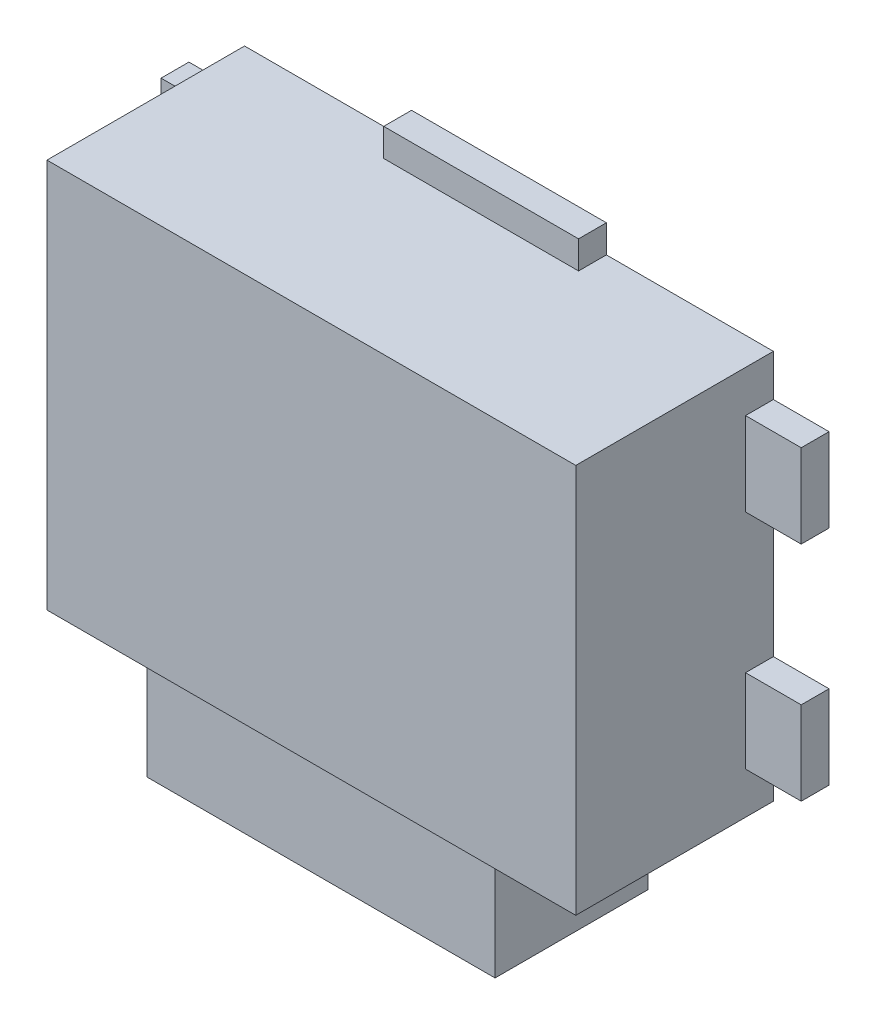
ISO-10303-21;
HEADER;
FILE_DESCRIPTION(('STEP AP214'),'2;1');
FILE_NAME('part.step','',(''),(''),'','','');
FILE_SCHEMA(('AUTOMOTIVE_DESIGN { 1 0 10303 214 1 1 1 1 }'));
ENDSEC;
DATA;
#1=APPLICATION_CONTEXT('core data for automotive mechanical design processes');
#2=APPLICATION_PROTOCOL_DEFINITION('international standard','automotive_design',2000,#1);
#3=PRODUCT_CONTEXT('',#1,'mechanical');
#4=PRODUCT('Part','Part','',(#3));
#5=PRODUCT_RELATED_PRODUCT_CATEGORY('part','',(#4));
#6=PRODUCT_DEFINITION_FORMATION('','',#4);
#7=PRODUCT_DEFINITION_CONTEXT('part definition',#1,'design');
#8=PRODUCT_DEFINITION('design','',#6,#7);
#9=PRODUCT_DEFINITION_SHAPE('','',#8);
#10=(LENGTH_UNIT() NAMED_UNIT(*) SI_UNIT(.MILLI.,.METRE.));
#11=(NAMED_UNIT(*) PLANE_ANGLE_UNIT() SI_UNIT($,.RADIAN.));
#12=(NAMED_UNIT(*) SI_UNIT($,.STERADIAN.) SOLID_ANGLE_UNIT());
#13=UNCERTAINTY_MEASURE_WITH_UNIT(LENGTH_MEASURE(1.E-05),#10,'distance_accuracy_value','');
#14=(GEOMETRIC_REPRESENTATION_CONTEXT(3) GLOBAL_UNCERTAINTY_ASSIGNED_CONTEXT((#13)) GLOBAL_UNIT_ASSIGNED_CONTEXT((#10,
#11,#12)) REPRESENTATION_CONTEXT('',''));
#15=CARTESIAN_POINT('',(0.,0.,0.));
#16=DIRECTION('',(0.,0.,1.));
#17=DIRECTION('',(1.,0.,0.));
#18=AXIS2_PLACEMENT_3D('',#15,#16,#17);
#19=CARTESIAN_POINT('',(1.25,-1.85,0.85));
#20=DIRECTION('',(0.,0.,-1.));
#21=DIRECTION('',(0.,-1.,0.));
#22=AXIS2_PLACEMENT_3D('',#19,#20,#21);
#23=PLANE('',#22);
#24=DIRECTION('',(1.,0.,0.));
#25=VECTOR('',#24,1.);
#26=CARTESIAN_POINT('',(-1.25,-0.4,0.85));
#27=LINE('',#26,#25);
#28=CARTESIAN_POINT('',(-1.25,-0.4,0.85));
#29=VERTEX_POINT('',#28);
#30=CARTESIAN_POINT('',(1.25,-0.4,0.85));
#31=VERTEX_POINT('',#30);
#32=EDGE_CURVE('E20',#29,#31,#27,.T.);
#33=ORIENTED_EDGE('',*,*,#32,.T.);
#34=DIRECTION('',(0.,-1.,0.));
#35=VECTOR('',#34,1.);
#36=CARTESIAN_POINT('',(1.25,-1.85,0.85));
#37=LINE('',#36,#35);
#38=CARTESIAN_POINT('',(1.25,-1.4,0.85));
#39=VERTEX_POINT('',#38);
#40=EDGE_CURVE('E629',#31,#39,#37,.T.);
#41=ORIENTED_EDGE('',*,*,#40,.T.);
#42=DIRECTION('',(0.,-1.,0.));
#43=VECTOR('',#42,1.);
#44=CARTESIAN_POINT('',(1.25,-1.85,0.85));
#45=LINE('',#44,#43);
#46=CARTESIAN_POINT('',(1.25,-1.85,0.85));
#47=VERTEX_POINT('',#46);
#48=EDGE_CURVE('E565',#39,#47,#45,.T.);
#49=ORIENTED_EDGE('',*,*,#48,.T.);
#50=DIRECTION('',(1.,0.,0.));
#51=VECTOR('',#50,1.);
#52=CARTESIAN_POINT('',(1.25,-1.85,0.85));
#53=LINE('',#52,#51);
#54=CARTESIAN_POINT('',(-1.25,-1.85,0.85));
#55=VERTEX_POINT('',#54);
#56=EDGE_CURVE('E11',#55,#47,#53,.T.);
#57=ORIENTED_EDGE('',*,*,#56,.F.);
#58=DIRECTION('',(0.,1.,0.));
#59=VECTOR('',#58,1.);
#60=CARTESIAN_POINT('',(-1.25,-1.85,0.85));
#61=LINE('',#60,#59);
#62=CARTESIAN_POINT('',(-1.25,-1.4,0.85));
#63=VERTEX_POINT('',#62);
#64=EDGE_CURVE('E432',#55,#63,#61,.T.);
#65=ORIENTED_EDGE('',*,*,#64,.T.);
#66=DIRECTION('',(0.,1.,0.));
#67=VECTOR('',#66,1.);
#68=CARTESIAN_POINT('',(-1.25,-1.85,0.85));
#69=LINE('',#68,#67);
#70=EDGE_CURVE('E342',#63,#29,#69,.T.);
#71=ORIENTED_EDGE('',*,*,#70,.T.);
#72=EDGE_LOOP('',(#33,#41,#49,#57,#65,#71));
#73=FACE_BOUND('',#72,.T.);
#74=ADVANCED_FACE('F17',(#73),#23,.T.);
#75=CARTESIAN_POINT('',(1.25,-1.85,0.15));
#76=DIRECTION('',(0.,1.,0.));
#77=DIRECTION('',(0.,0.,-1.));
#78=AXIS2_PLACEMENT_3D('',#75,#76,#77);
#79=PLANE('',#78);
#80=DIRECTION('',(0.,0.,1.));
#81=VECTOR('',#80,1.);
#82=CARTESIAN_POINT('',(-1.25,-1.85,0.15));
#83=LINE('',#82,#81);
#84=CARTESIAN_POINT('',(-1.25,-1.85,0.25));
#85=VERTEX_POINT('',#84);
#86=EDGE_CURVE('E435',#85,#55,#83,.T.);
#87=ORIENTED_EDGE('',*,*,#86,.T.);
#88=ORIENTED_EDGE('',*,*,#56,.T.);
#89=DIRECTION('',(0.,0.,-1.));
#90=VECTOR('',#89,1.);
#91=CARTESIAN_POINT('',(1.25,-1.85,0.15));
#92=LINE('',#91,#90);
#93=CARTESIAN_POINT('',(1.25,-1.85,0.25));
#94=VERTEX_POINT('',#93);
#95=EDGE_CURVE('E564',#47,#94,#92,.T.);
#96=ORIENTED_EDGE('',*,*,#95,.T.);
#97=DIRECTION('',(1.,0.,0.));
#98=VECTOR('',#97,1.);
#99=CARTESIAN_POINT('',(1.25,-1.85,0.25));
#100=LINE('',#99,#98);
#101=EDGE_CURVE('E635',#85,#94,#100,.T.);
#102=ORIENTED_EDGE('',*,*,#101,.F.);
#103=EDGE_LOOP('',(#87,#88,#96,#102));
#104=FACE_BOUND('',#103,.T.);
#105=ADVANCED_FACE('F1546',(#104),#79,.T.);
#106=CARTESIAN_POINT('',(-1.25,-0.4,1.35));
#107=DIRECTION('',(0.,-1.,0.));
#108=DIRECTION('',(-1.,0.,0.));
#109=AXIS2_PLACEMENT_3D('',#106,#107,#108);
#110=PLANE('',#109);
#111=ORIENTED_EDGE('',*,*,#32,.F.);
#112=DIRECTION('',(0.,0.,-1.));
#113=VECTOR('',#112,1.);
#114=CARTESIAN_POINT('',(-1.25,-0.4,1.35));
#115=LINE('',#114,#113);
#116=CARTESIAN_POINT('',(-1.25,-0.4,1.35));
#117=VERTEX_POINT('',#116);
#118=EDGE_CURVE('E538',#117,#29,#115,.T.);
#119=ORIENTED_EDGE('',*,*,#118,.F.);
#120=DIRECTION('',(-1.,0.,0.));
#121=VECTOR('',#120,1.);
#122=CARTESIAN_POINT('',(-1.25,-0.4,1.35));
#123=LINE('',#122,#121);
#124=CARTESIAN_POINT('',(1.25,-0.4,1.35));
#125=VERTEX_POINT('',#124);
#126=EDGE_CURVE('E39',#125,#117,#123,.T.);
#127=ORIENTED_EDGE('',*,*,#126,.F.);
#128=DIRECTION('',(0.,0.,1.));
#129=VECTOR('',#128,1.);
#130=CARTESIAN_POINT('',(1.25,-0.4,1.35));
#131=LINE('',#130,#129);
#132=EDGE_CURVE('E559',#31,#125,#131,.T.);
#133=ORIENTED_EDGE('',*,*,#132,.F.);
#134=EDGE_LOOP('',(#111,#119,#127,#133));
#135=FACE_BOUND('',#134,.T.);
#136=ADVANCED_FACE('F732',(#135),#110,.F.);
#137=CARTESIAN_POINT('',(1.25,-0.4,0.25));
#138=DIRECTION('',(0.,0.,-1.));
#139=DIRECTION('',(0.,-1.,0.));
#140=AXIS2_PLACEMENT_3D('',#137,#138,#139);
#141=PLANE('',#140);
#142=DIRECTION('',(1.,0.,0.));
#143=VECTOR('',#142,1.);
#144=CARTESIAN_POINT('',(-1.25,-2.15,0.25));
#145=LINE('',#144,#143);
#146=CARTESIAN_POINT('',(-1.25,-2.15,0.25));
#147=VERTEX_POINT('',#146);
#148=CARTESIAN_POINT('',(1.25,-2.15,0.25));
#149=VERTEX_POINT('',#148);
#150=EDGE_CURVE('E475',#147,#149,#145,.T.);
#151=ORIENTED_EDGE('',*,*,#150,.F.);
#152=DIRECTION('',(0.,1.,0.));
#153=VECTOR('',#152,1.);
#154=CARTESIAN_POINT('',(-1.25,-0.4,0.25));
#155=LINE('',#154,#153);
#156=EDGE_CURVE('E589',#147,#85,#155,.T.);
#157=ORIENTED_EDGE('',*,*,#156,.T.);
#158=ORIENTED_EDGE('',*,*,#101,.T.);
#159=DIRECTION('',(0.,-1.,0.));
#160=VECTOR('',#159,1.);
#161=CARTESIAN_POINT('',(1.25,-0.4,0.25));
#162=LINE('',#161,#160);
#163=EDGE_CURVE('E554',#94,#149,#162,.T.);
#164=ORIENTED_EDGE('',*,*,#163,.T.);
#165=EDGE_LOOP('',(#151,#157,#158,#164));
#166=FACE_BOUND('',#165,.T.);
#167=ADVANCED_FACE('F1525',(#166),#141,.T.);
#168=CARTESIAN_POINT('',(-1.25,-1.4,1.35));
#169=DIRECTION('',(0.,0.,-1.));
#170=DIRECTION('',(0.,-1.,0.));
#171=AXIS2_PLACEMENT_3D('',#168,#169,#170);
#172=PLANE('',#171);
#173=DIRECTION('',(-1.,0.,0.));
#174=VECTOR('',#173,1.);
#175=CARTESIAN_POINT('',(-1.25,0.6,1.35));
#176=LINE('',#175,#174);
#177=CARTESIAN_POINT('',(1.25,0.6,1.35));
#178=VERTEX_POINT('',#177);
#179=CARTESIAN_POINT('',(-1.25,0.6,1.35));
#180=VERTEX_POINT('',#179);
#181=EDGE_CURVE('E628',#178,#180,#176,.T.);
#182=ORIENTED_EDGE('',*,*,#181,.F.);
#183=DIRECTION('',(0.,1.,0.));
#184=VECTOR('',#183,1.);
#185=CARTESIAN_POINT('',(1.25,-1.4,1.35));
#186=LINE('',#185,#184);
#187=EDGE_CURVE('E478',#125,#178,#186,.T.);
#188=ORIENTED_EDGE('',*,*,#187,.F.);
#189=ORIENTED_EDGE('',*,*,#126,.T.);
#190=DIRECTION('',(0.,1.,0.));
#191=VECTOR('',#190,1.);
#192=CARTESIAN_POINT('',(-1.25,-1.4,1.35));
#193=LINE('',#192,#191);
#194=EDGE_CURVE('E503',#117,#180,#193,.T.);
#195=ORIENTED_EDGE('',*,*,#194,.T.);
#196=EDGE_LOOP('',(#182,#188,#189,#195));
#197=FACE_BOUND('',#196,.T.);
#198=ADVANCED_FACE('F1516',(#197),#172,.T.);
#199=CARTESIAN_POINT('',(-2.3,0.5,0.));
#200=DIRECTION('',(-1.,0.,0.));
#201=DIRECTION('',(0.,0.,1.));
#202=AXIS2_PLACEMENT_3D('',#199,#200,#201);
#203=PLANE('',#202);
#204=DIRECTION('',(0.,0.,1.));
#205=VECTOR('',#204,1.);
#206=CARTESIAN_POINT('',(-2.3,1.1,0.));
#207=LINE('',#206,#205);
#208=CARTESIAN_POINT('',(-2.3,1.1,0.));
#209=VERTEX_POINT('',#208);
#210=CARTESIAN_POINT('',(-2.3,1.1,0.2));
#211=VERTEX_POINT('',#210);
#212=EDGE_CURVE('E541',#209,#211,#207,.T.);
#213=ORIENTED_EDGE('',*,*,#212,.F.);
#214=DIRECTION('',(0.,-1.,0.));
#215=VECTOR('',#214,1.);
#216=CARTESIAN_POINT('',(-2.3,0.5,0.));
#217=LINE('',#216,#215);
#218=CARTESIAN_POINT('',(-2.3,0.5,0.));
#219=VERTEX_POINT('',#218);
#220=EDGE_CURVE('E582',#209,#219,#217,.T.);
#221=ORIENTED_EDGE('',*,*,#220,.T.);
#222=DIRECTION('',(0.,0.,-1.));
#223=VECTOR('',#222,1.);
#224=CARTESIAN_POINT('',(-2.3,0.5,0.));
#225=LINE('',#224,#223);
#226=CARTESIAN_POINT('',(-2.3,0.5,0.2));
#227=VERTEX_POINT('',#226);
#228=EDGE_CURVE('E510',#227,#219,#225,.T.);
#229=ORIENTED_EDGE('',*,*,#228,.F.);
#230=DIRECTION('',(0.,-1.,0.));
#231=VECTOR('',#230,1.);
#232=CARTESIAN_POINT('',(-2.3,1.1,0.2));
#233=LINE('',#232,#231);
#234=EDGE_CURVE('E620',#211,#227,#233,.T.);
#235=ORIENTED_EDGE('',*,*,#234,.F.);
#236=EDGE_LOOP('',(#213,#221,#229,#235));
#237=FACE_BOUND('',#236,.T.);
#238=ADVANCED_FACE('F1417',(#237),#203,.T.);
#239=CARTESIAN_POINT('',(-2.299999999999,-1.1,0.));
#240=DIRECTION('',(-1.,0.,0.));
#241=DIRECTION('',(0.,0.,1.));
#242=AXIS2_PLACEMENT_3D('',#239,#240,#241);
#243=PLANE('',#242);
#244=DIRECTION('',(0.,0.,1.));
#245=VECTOR('',#244,1.);
#246=CARTESIAN_POINT('',(-2.299999999999,-0.5,0.));
#247=LINE('',#246,#245);
#248=CARTESIAN_POINT('',(-2.299999999999,-0.5,0.));
#249=VERTEX_POINT('',#248);
#250=CARTESIAN_POINT('',(-2.299999999999,-0.5,0.2));
#251=VERTEX_POINT('',#250);
#252=EDGE_CURVE('E511',#249,#251,#247,.T.);
#253=ORIENTED_EDGE('',*,*,#252,.F.);
#254=DIRECTION('',(0.,-1.,0.));
#255=VECTOR('',#254,1.);
#256=CARTESIAN_POINT('',(-2.299999999999,-1.1,0.));
#257=LINE('',#256,#255);
#258=CARTESIAN_POINT('',(-2.299999999999,-1.1,0.));
#259=VERTEX_POINT('',#258);
#260=EDGE_CURVE('E458',#249,#259,#257,.T.);
#261=ORIENTED_EDGE('',*,*,#260,.T.);
#262=DIRECTION('',(0.,0.,-1.));
#263=VECTOR('',#262,1.);
#264=CARTESIAN_POINT('',(-2.299999999999,-1.1,0.));
#265=LINE('',#264,#263);
#266=CARTESIAN_POINT('',(-2.299999999999,-1.1,0.2));
#267=VERTEX_POINT('',#266);
#268=EDGE_CURVE('E431',#267,#259,#265,.T.);
#269=ORIENTED_EDGE('',*,*,#268,.F.);
#270=DIRECTION('',(0.,-1.,0.));
#271=VECTOR('',#270,1.);
#272=CARTESIAN_POINT('',(-2.299999999999,-0.5,0.2));
#273=LINE('',#272,#271);
#274=EDGE_CURVE('E430',#251,#267,#273,.T.);
#275=ORIENTED_EDGE('',*,*,#274,.F.);
#276=EDGE_LOOP('',(#253,#261,#269,#275));
#277=FACE_BOUND('',#276,.T.);
#278=ADVANCED_FACE('F1412',(#277),#243,.T.);
#279=CARTESIAN_POINT('',(-1.25,-2.15,1.35));
#280=DIRECTION('',(0.,-1.,0.));
#281=DIRECTION('',(-1.,0.,0.));
#282=AXIS2_PLACEMENT_3D('',#279,#280,#281);
#283=PLANE('',#282);
#284=DIRECTION('',(0.,0.,1.));
#285=VECTOR('',#284,1.);
#286=CARTESIAN_POINT('',(1.25,-2.15,1.35));
#287=LINE('',#286,#285);
#288=CARTESIAN_POINT('',(1.25,-2.15,1.35));
#289=VERTEX_POINT('',#288);
#290=EDGE_CURVE('E573',#149,#289,#287,.T.);
#291=ORIENTED_EDGE('',*,*,#290,.T.);
#292=DIRECTION('',(1.,0.,0.));
#293=VECTOR('',#292,1.);
#294=CARTESIAN_POINT('',(-1.25,-2.15,1.35));
#295=LINE('',#294,#293);
#296=CARTESIAN_POINT('',(-1.25,-2.15,1.35));
#297=VERTEX_POINT('',#296);
#298=EDGE_CURVE('E551',#297,#289,#295,.T.);
#299=ORIENTED_EDGE('',*,*,#298,.F.);
#300=DIRECTION('',(0.,0.,1.));
#301=VECTOR('',#300,1.);
#302=CARTESIAN_POINT('',(-1.25,-2.15,0.25));
#303=LINE('',#302,#301);
#304=EDGE_CURVE('E416',#147,#297,#303,.T.);
#305=ORIENTED_EDGE('',*,*,#304,.F.);
#306=ORIENTED_EDGE('',*,*,#150,.T.);
#307=EDGE_LOOP('',(#291,#299,#305,#306));
#308=FACE_BOUND('',#307,.T.);
#309=ADVANCED_FACE('F1416',(#308),#283,.T.);
#310=CARTESIAN_POINT('',(1.25,-1.4,1.35));
#311=DIRECTION('',(-1.,0.,0.));
#312=DIRECTION('',(0.,0.,1.));
#313=AXIS2_PLACEMENT_3D('',#310,#311,#312);
#314=PLANE('',#313);
#315=DIRECTION('',(0.,0.,1.));
#316=VECTOR('',#315,1.);
#317=CARTESIAN_POINT('',(1.25,-1.4,1.35));
#318=LINE('',#317,#316);
#319=CARTESIAN_POINT('',(1.25,-1.4,0.8));
#320=VERTEX_POINT('',#319);
#321=EDGE_CURVE('E353',#320,#39,#318,.T.);
#322=ORIENTED_EDGE('',*,*,#321,.T.);
#323=ORIENTED_EDGE('',*,*,#40,.F.);
#324=ORIENTED_EDGE('',*,*,#132,.T.);
#325=ORIENTED_EDGE('',*,*,#187,.T.);
#326=DIRECTION('',(0.,0.,1.));
#327=VECTOR('',#326,1.);
#328=CARTESIAN_POINT('',(1.25,0.6,1.35));
#329=LINE('',#328,#327);
#330=CARTESIAN_POINT('',(1.25,0.6,0.8));
#331=VERTEX_POINT('',#330);
#332=EDGE_CURVE('E523',#331,#178,#329,.T.);
#333=ORIENTED_EDGE('',*,*,#332,.F.);
#334=DIRECTION('',(0.,1.,0.));
#335=VECTOR('',#334,1.);
#336=CARTESIAN_POINT('',(1.25,-1.4,0.8));
#337=LINE('',#336,#335);
#338=EDGE_CURVE('E335',#320,#331,#337,.T.);
#339=ORIENTED_EDGE('',*,*,#338,.F.);
#340=EDGE_LOOP('',(#322,#323,#324,#325,#333,#339));
#341=FACE_BOUND('',#340,.T.);
#342=ADVANCED_FACE('F728',(#341),#314,.T.);
#343=CARTESIAN_POINT('',(-1.25,0.6,1.35));
#344=DIRECTION('',(0.,-1.,0.));
#345=DIRECTION('',(0.,0.,-1.));
#346=AXIS2_PLACEMENT_3D('',#343,#344,#345);
#347=PLANE('',#346);
#348=ORIENTED_EDGE('',*,*,#332,.T.);
#349=ORIENTED_EDGE('',*,*,#181,.T.);
#350=DIRECTION('',(0.,0.,1.));
#351=VECTOR('',#350,1.);
#352=CARTESIAN_POINT('',(-1.25,0.6,0.8));
#353=LINE('',#352,#351);
#354=CARTESIAN_POINT('',(-1.25,0.6,0.8));
#355=VERTEX_POINT('',#354);
#356=EDGE_CURVE('E500',#355,#180,#353,.T.);
#357=ORIENTED_EDGE('',*,*,#356,.F.);
#358=DIRECTION('',(-1.,0.,0.));
#359=VECTOR('',#358,1.);
#360=CARTESIAN_POINT('',(1.25,0.6,0.8));
#361=LINE('',#360,#359);
#362=EDGE_CURVE('E331',#331,#355,#361,.T.);
#363=ORIENTED_EDGE('',*,*,#362,.F.);
#364=EDGE_LOOP('',(#348,#349,#357,#363));
#365=FACE_BOUND('',#364,.T.);
#366=ADVANCED_FACE('F731',(#365),#347,.T.);
#367=CARTESIAN_POINT('',(-1.25,-1.4,0.8));
#368=DIRECTION('',(1.,0.,0.));
#369=DIRECTION('',(0.,1.,0.));
#370=AXIS2_PLACEMENT_3D('',#367,#368,#369);
#371=PLANE('',#370);
#372=ORIENTED_EDGE('',*,*,#118,.T.);
#373=ORIENTED_EDGE('',*,*,#70,.F.);
#374=DIRECTION('',(0.,0.,-1.));
#375=VECTOR('',#374,1.);
#376=CARTESIAN_POINT('',(-1.25,-1.4,0.8));
#377=LINE('',#376,#375);
#378=CARTESIAN_POINT('',(-1.25,-1.4,0.8));
#379=VERTEX_POINT('',#378);
#380=EDGE_CURVE('E339',#63,#379,#377,.T.);
#381=ORIENTED_EDGE('',*,*,#380,.T.);
#382=DIRECTION('',(0.,-1.,0.));
#383=VECTOR('',#382,1.);
#384=CARTESIAN_POINT('',(-1.25,-1.4,0.8));
#385=LINE('',#384,#383);
#386=EDGE_CURVE('E323',#355,#379,#385,.T.);
#387=ORIENTED_EDGE('',*,*,#386,.F.);
#388=ORIENTED_EDGE('',*,*,#356,.T.);
#389=ORIENTED_EDGE('',*,*,#194,.F.);
#390=EDGE_LOOP('',(#372,#373,#381,#387,#388,#389));
#391=FACE_BOUND('',#390,.T.);
#392=ADVANCED_FACE('F341',(#391),#371,.T.);
#393=CARTESIAN_POINT('',(2.3,-0.5,0.));
#394=DIRECTION('',(1.,0.,0.));
#395=DIRECTION('',(0.,1.,0.));
#396=AXIS2_PLACEMENT_3D('',#393,#394,#395);
#397=PLANE('',#396);
#398=DIRECTION('',(0.,0.,1.));
#399=VECTOR('',#398,1.);
#400=CARTESIAN_POINT('',(2.3,-1.1,0.));
#401=LINE('',#400,#399);
#402=CARTESIAN_POINT('',(2.3,-1.1,0.));
#403=VERTEX_POINT('',#402);
#404=CARTESIAN_POINT('',(2.3,-1.1,0.2));
#405=VERTEX_POINT('',#404);
#406=EDGE_CURVE('E336',#403,#405,#401,.T.);
#407=ORIENTED_EDGE('',*,*,#406,.F.);
#408=DIRECTION('',(0.,1.,0.));
#409=VECTOR('',#408,1.);
#410=CARTESIAN_POINT('',(2.3,-0.5,0.));
#411=LINE('',#410,#409);
#412=CARTESIAN_POINT('',(2.3,-0.5,0.));
#413=VERTEX_POINT('',#412);
#414=EDGE_CURVE('E459',#403,#413,#411,.T.);
#415=ORIENTED_EDGE('',*,*,#414,.T.);
#416=DIRECTION('',(0.,0.,-1.));
#417=VECTOR('',#416,1.);
#418=CARTESIAN_POINT('',(2.3,-0.5,0.));
#419=LINE('',#418,#417);
#420=CARTESIAN_POINT('',(2.3,-0.5,0.2));
#421=VERTEX_POINT('',#420);
#422=EDGE_CURVE('E545',#421,#413,#419,.T.);
#423=ORIENTED_EDGE('',*,*,#422,.F.);
#424=DIRECTION('',(0.,1.,0.));
#425=VECTOR('',#424,1.);
#426=CARTESIAN_POINT('',(2.3,-0.5,0.2));
#427=LINE('',#426,#425);
#428=EDGE_CURVE('E388',#405,#421,#427,.T.);
#429=ORIENTED_EDGE('',*,*,#428,.F.);
#430=EDGE_LOOP('',(#407,#415,#423,#429));
#431=FACE_BOUND('',#430,.T.);
#432=ADVANCED_FACE('F1459',(#431),#397,.T.);
#433=CARTESIAN_POINT('',(2.3,1.1,0.));
#434=DIRECTION('',(1.,0.,0.));
#435=DIRECTION('',(0.,1.,0.));
#436=AXIS2_PLACEMENT_3D('',#433,#434,#435);
#437=PLANE('',#436);
#438=DIRECTION('',(0.,0.,1.));
#439=VECTOR('',#438,1.);
#440=CARTESIAN_POINT('',(2.3,0.5,0.));
#441=LINE('',#440,#439);
#442=CARTESIAN_POINT('',(2.3,0.5,0.));
#443=VERTEX_POINT('',#442);
#444=CARTESIAN_POINT('',(2.3,0.5,0.2));
#445=VERTEX_POINT('',#444);
#446=EDGE_CURVE('E403',#443,#445,#441,.T.);
#447=ORIENTED_EDGE('',*,*,#446,.F.);
#448=DIRECTION('',(0.,1.,0.));
#449=VECTOR('',#448,1.);
#450=CARTESIAN_POINT('',(2.3,1.1,0.));
#451=LINE('',#450,#449);
#452=CARTESIAN_POINT('',(2.3,1.1,0.));
#453=VERTEX_POINT('',#452);
#454=EDGE_CURVE('E415',#443,#453,#451,.T.);
#455=ORIENTED_EDGE('',*,*,#454,.T.);
#456=DIRECTION('',(0.,0.,-1.));
#457=VECTOR('',#456,1.);
#458=CARTESIAN_POINT('',(2.3,1.1,0.));
#459=LINE('',#458,#457);
#460=CARTESIAN_POINT('',(2.3,1.1,0.2));
#461=VERTEX_POINT('',#460);
#462=EDGE_CURVE('E462',#461,#453,#459,.T.);
#463=ORIENTED_EDGE('',*,*,#462,.F.);
#464=DIRECTION('',(0.,1.,0.));
#465=VECTOR('',#464,1.);
#466=CARTESIAN_POINT('',(2.3,1.1,0.2));
#467=LINE('',#466,#465);
#468=EDGE_CURVE('E529',#445,#461,#467,.T.);
#469=ORIENTED_EDGE('',*,*,#468,.F.);
#470=EDGE_LOOP('',(#447,#455,#463,#469));
#471=FACE_BOUND('',#470,.T.);
#472=ADVANCED_FACE('F688',(#471),#437,.T.);
#473=CARTESIAN_POINT('',(-0.7,1.6,0.));
#474=DIRECTION('',(0.,1.,0.));
#475=DIRECTION('',(1.,0.,0.));
#476=AXIS2_PLACEMENT_3D('',#473,#474,#475);
#477=PLANE('',#476);
#478=DIRECTION('',(0.,0.,1.));
#479=VECTOR('',#478,1.);
#480=CARTESIAN_POINT('',(0.7,1.6,0.));
#481=LINE('',#480,#479);
#482=CARTESIAN_POINT('',(0.7,1.6,0.));
#483=VERTEX_POINT('',#482);
#484=CARTESIAN_POINT('',(0.7,1.6,0.2));
#485=VERTEX_POINT('',#484);
#486=EDGE_CURVE('E517',#483,#485,#481,.T.);
#487=ORIENTED_EDGE('',*,*,#486,.F.);
#488=DIRECTION('',(-1.,0.,0.));
#489=VECTOR('',#488,1.);
#490=CARTESIAN_POINT('',(-0.7,1.6,0.));
#491=LINE('',#490,#489);
#492=CARTESIAN_POINT('',(-0.7,1.6,0.));
#493=VERTEX_POINT('',#492);
#494=EDGE_CURVE('E412',#483,#493,#491,.T.);
#495=ORIENTED_EDGE('',*,*,#494,.T.);
#496=DIRECTION('',(0.,0.,1.));
#497=VECTOR('',#496,1.);
#498=CARTESIAN_POINT('',(-0.7,1.6,0.));
#499=LINE('',#498,#497);
#500=CARTESIAN_POINT('',(-0.7,1.6,0.2));
#501=VERTEX_POINT('',#500);
#502=EDGE_CURVE('E495',#493,#501,#499,.T.);
#503=ORIENTED_EDGE('',*,*,#502,.T.);
#504=DIRECTION('',(-1.,0.,0.));
#505=VECTOR('',#504,1.);
#506=CARTESIAN_POINT('',(-0.7,1.6,0.2));
#507=LINE('',#506,#505);
#508=EDGE_CURVE('E394',#485,#501,#507,.T.);
#509=ORIENTED_EDGE('',*,*,#508,.F.);
#510=EDGE_LOOP('',(#487,#495,#503,#509));
#511=FACE_BOUND('',#510,.T.);
#512=ADVANCED_FACE('F1442',(#511),#477,.T.);
#513=CARTESIAN_POINT('',(-2.3,1.1,0.));
#514=DIRECTION('',(0.,1.,0.));
#515=DIRECTION('',(1.,0.,0.));
#516=AXIS2_PLACEMENT_3D('',#513,#514,#515);
#517=PLANE('',#516);
#518=DIRECTION('',(-1.,0.,0.));
#519=VECTOR('',#518,1.);
#520=CARTESIAN_POINT('',(-2.3,1.1,0.2));
#521=LINE('',#520,#519);
#522=CARTESIAN_POINT('',(-1.9,1.1,0.2));
#523=VERTEX_POINT('',#522);
#524=EDGE_CURVE('E616',#523,#211,#521,.T.);
#525=ORIENTED_EDGE('',*,*,#524,.F.);
#526=DIRECTION('',(0.,0.,1.));
#527=VECTOR('',#526,1.);
#528=CARTESIAN_POINT('',(-1.9,1.1,0.));
#529=LINE('',#528,#527);
#530=CARTESIAN_POINT('',(-1.9,1.1,0.));
#531=VERTEX_POINT('',#530);
#532=EDGE_CURVE('E417',#531,#523,#529,.T.);
#533=ORIENTED_EDGE('',*,*,#532,.F.);
#534=DIRECTION('',(-1.,0.,0.));
#535=VECTOR('',#534,1.);
#536=CARTESIAN_POINT('',(-2.3,1.1,0.));
#537=LINE('',#536,#535);
#538=EDGE_CURVE('E600',#531,#209,#537,.T.);
#539=ORIENTED_EDGE('',*,*,#538,.T.);
#540=ORIENTED_EDGE('',*,*,#212,.T.);
#541=EDGE_LOOP('',(#525,#533,#539,#540));
#542=FACE_BOUND('',#541,.T.);
#543=ADVANCED_FACE('F1397',(#542),#517,.T.);
#544=CARTESIAN_POINT('',(-2.3,1.1,0.2));
#545=DIRECTION('',(0.,0.,1.));
#546=DIRECTION('',(1.,0.,0.));
#547=AXIS2_PLACEMENT_3D('',#544,#545,#546);
#548=PLANE('',#547);
#549=DIRECTION('',(-1.,0.,0.));
#550=VECTOR('',#549,1.);
#551=CARTESIAN_POINT('',(-1.6,0.5,0.2));
#552=LINE('',#551,#550);
#553=CARTESIAN_POINT('',(-1.9,0.5,0.2));
#554=VERTEX_POINT('',#553);
#555=EDGE_CURVE('E506',#554,#227,#552,.T.);
#556=ORIENTED_EDGE('',*,*,#555,.F.);
#557=DIRECTION('',(0.,-1.,0.));
#558=VECTOR('',#557,1.);
#559=CARTESIAN_POINT('',(-1.9,-1.4,0.2));
#560=LINE('',#559,#558);
#561=EDGE_CURVE('E421',#523,#554,#560,.T.);
#562=ORIENTED_EDGE('',*,*,#561,.F.);
#563=ORIENTED_EDGE('',*,*,#524,.T.);
#564=ORIENTED_EDGE('',*,*,#234,.T.);
#565=EDGE_LOOP('',(#556,#562,#563,#564));
#566=FACE_BOUND('',#565,.T.);
#567=ADVANCED_FACE('F1392',(#566),#548,.T.);
#568=CARTESIAN_POINT('',(-1.6,0.5,0.));
#569=DIRECTION('',(0.,-1.,0.));
#570=DIRECTION('',(0.,0.,-1.));
#571=AXIS2_PLACEMENT_3D('',#568,#569,#570);
#572=PLANE('',#571);
#573=ORIENTED_EDGE('',*,*,#555,.T.);
#574=ORIENTED_EDGE('',*,*,#228,.T.);
#575=DIRECTION('',(1.,0.,0.));
#576=VECTOR('',#575,1.);
#577=CARTESIAN_POINT('',(-1.6,0.5,0.));
#578=LINE('',#577,#576);
#579=CARTESIAN_POINT('',(-1.9,0.5,0.));
#580=VERTEX_POINT('',#579);
#581=EDGE_CURVE('E516',#219,#580,#578,.T.);
#582=ORIENTED_EDGE('',*,*,#581,.T.);
#583=DIRECTION('',(0.,0.,-1.));
#584=VECTOR('',#583,1.);
#585=CARTESIAN_POINT('',(-1.9,0.5,0.));
#586=LINE('',#585,#584);
#587=EDGE_CURVE('E474',#554,#580,#586,.T.);
#588=ORIENTED_EDGE('',*,*,#587,.F.);
#589=EDGE_LOOP('',(#573,#574,#582,#588));
#590=FACE_BOUND('',#589,.T.);
#591=ADVANCED_FACE('F1396',(#590),#572,.T.);
#592=CARTESIAN_POINT('',(-2.299999999999,-0.5,0.));
#593=DIRECTION('',(0.,1.,0.));
#594=DIRECTION('',(1.,0.,0.));
#595=AXIS2_PLACEMENT_3D('',#592,#593,#594);
#596=PLANE('',#595);
#597=DIRECTION('',(-1.,0.,0.));
#598=VECTOR('',#597,1.);
#599=CARTESIAN_POINT('',(-2.299999999999,-0.5,0.2));
#600=LINE('',#599,#598);
#601=CARTESIAN_POINT('',(-1.9,-0.5,0.2));
#602=VERTEX_POINT('',#601);
#603=EDGE_CURVE('E426',#602,#251,#600,.T.);
#604=ORIENTED_EDGE('',*,*,#603,.F.);
#605=DIRECTION('',(0.,0.,1.));
#606=VECTOR('',#605,1.);
#607=CARTESIAN_POINT('',(-1.9,-0.5,0.));
#608=LINE('',#607,#606);
#609=CARTESIAN_POINT('',(-1.9,-0.5,0.));
#610=VERTEX_POINT('',#609);
#611=EDGE_CURVE('E486',#610,#602,#608,.T.);
#612=ORIENTED_EDGE('',*,*,#611,.F.);
#613=DIRECTION('',(-1.,0.,0.));
#614=VECTOR('',#613,1.);
#615=CARTESIAN_POINT('',(-2.299999999999,-0.5,0.));
#616=LINE('',#615,#614);
#617=EDGE_CURVE('E512',#610,#249,#616,.T.);
#618=ORIENTED_EDGE('',*,*,#617,.T.);
#619=ORIENTED_EDGE('',*,*,#252,.T.);
#620=EDGE_LOOP('',(#604,#612,#618,#619));
#621=FACE_BOUND('',#620,.T.);
#622=ADVANCED_FACE('F1406',(#621),#596,.T.);
#623=CARTESIAN_POINT('',(-2.299999999999,-0.5,0.2));
#624=DIRECTION('',(0.,0.,1.));
#625=DIRECTION('',(1.,0.,0.));
#626=AXIS2_PLACEMENT_3D('',#623,#624,#625);
#627=PLANE('',#626);
#628=DIRECTION('',(-1.,0.,0.));
#629=VECTOR('',#628,1.);
#630=CARTESIAN_POINT('',(-1.599999999999,-1.1,0.2));
#631=LINE('',#630,#629);
#632=CARTESIAN_POINT('',(-1.9,-1.1,0.2));
#633=VERTEX_POINT('',#632);
#634=EDGE_CURVE('E604',#633,#267,#631,.T.);
#635=ORIENTED_EDGE('',*,*,#634,.F.);
#636=DIRECTION('',(0.,-1.,0.));
#637=VECTOR('',#636,1.);
#638=CARTESIAN_POINT('',(-1.9,-1.4,0.2));
#639=LINE('',#638,#637);
#640=EDGE_CURVE('E446',#602,#633,#639,.T.);
#641=ORIENTED_EDGE('',*,*,#640,.F.);
#642=ORIENTED_EDGE('',*,*,#603,.T.);
#643=ORIENTED_EDGE('',*,*,#274,.T.);
#644=EDGE_LOOP('',(#635,#641,#642,#643));
#645=FACE_BOUND('',#644,.T.);
#646=ADVANCED_FACE('F1386',(#645),#627,.T.);
#647=CARTESIAN_POINT('',(-1.599999999999,-1.1,0.));
#648=DIRECTION('',(0.,-1.,0.));
#649=DIRECTION('',(0.,0.,-1.));
#650=AXIS2_PLACEMENT_3D('',#647,#648,#649);
#651=PLANE('',#650);
#652=ORIENTED_EDGE('',*,*,#634,.T.);
#653=ORIENTED_EDGE('',*,*,#268,.T.);
#654=DIRECTION('',(1.,0.,0.));
#655=VECTOR('',#654,1.);
#656=CARTESIAN_POINT('',(-1.599999999999,-1.1,0.));
#657=LINE('',#656,#655);
#658=CARTESIAN_POINT('',(-1.9,-1.1,0.));
#659=VERTEX_POINT('',#658);
#660=EDGE_CURVE('E455',#259,#659,#657,.T.);
#661=ORIENTED_EDGE('',*,*,#660,.T.);
#662=DIRECTION('',(0.,0.,-1.));
#663=VECTOR('',#662,1.);
#664=CARTESIAN_POINT('',(-1.9,-1.1,0.));
#665=LINE('',#664,#663);
#666=EDGE_CURVE('E450',#633,#659,#665,.T.);
#667=ORIENTED_EDGE('',*,*,#666,.F.);
#668=EDGE_LOOP('',(#652,#653,#661,#667));
#669=FACE_BOUND('',#668,.T.);
#670=ADVANCED_FACE('F1378',(#669),#651,.T.);
#671=CARTESIAN_POINT('',(-1.9,1.4,0.));
#672=DIRECTION('',(0.,0.,1.));
#673=DIRECTION('',(1.,0.,0.));
#674=AXIS2_PLACEMENT_3D('',#671,#672,#673);
#675=PLANE('',#674);
#676=DIRECTION('',(-1.,0.,0.));
#677=VECTOR('',#676,1.);
#678=CARTESIAN_POINT('',(-1.9,1.4,0.));
#679=LINE('',#678,#677);
#680=CARTESIAN_POINT('',(-0.7,1.4,0.));
#681=VERTEX_POINT('',#680);
#682=CARTESIAN_POINT('',(-1.9,1.4,0.));
#683=VERTEX_POINT('',#682);
#684=EDGE_CURVE('E713',#681,#683,#679,.T.);
#685=ORIENTED_EDGE('',*,*,#684,.F.);
#686=DIRECTION('',(0.,-1.,0.));
#687=VECTOR('',#686,1.);
#688=CARTESIAN_POINT('',(-0.7,1.6,0.));
#689=LINE('',#688,#687);
#690=EDGE_CURVE('E499',#493,#681,#689,.T.);
#691=ORIENTED_EDGE('',*,*,#690,.F.);
#692=ORIENTED_EDGE('',*,*,#494,.F.);
#693=DIRECTION('',(0.,1.,0.));
#694=VECTOR('',#693,1.);
#695=CARTESIAN_POINT('',(0.7,1.6,0.));
#696=LINE('',#695,#694);
#697=CARTESIAN_POINT('',(0.7,1.4,0.));
#698=VERTEX_POINT('',#697);
#699=EDGE_CURVE('E397',#698,#483,#696,.T.);
#700=ORIENTED_EDGE('',*,*,#699,.F.);
#701=DIRECTION('',(-1.,0.,0.));
#702=VECTOR('',#701,1.);
#703=CARTESIAN_POINT('',(-1.9,1.4,0.));
#704=LINE('',#703,#702);
#705=CARTESIAN_POINT('',(1.9,1.4,0.));
#706=VERTEX_POINT('',#705);
#707=EDGE_CURVE('E650',#706,#698,#704,.T.);
#708=ORIENTED_EDGE('',*,*,#707,.F.);
#709=DIRECTION('',(0.,1.,0.));
#710=VECTOR('',#709,1.);
#711=CARTESIAN_POINT('',(1.9,1.4,0.));
#712=LINE('',#711,#710);
#713=CARTESIAN_POINT('',(1.9,1.1,0.));
#714=VERTEX_POINT('',#713);
#715=EDGE_CURVE('E371',#714,#706,#712,.T.);
#716=ORIENTED_EDGE('',*,*,#715,.F.);
#717=DIRECTION('',(-1.,0.,0.));
#718=VECTOR('',#717,1.);
#719=CARTESIAN_POINT('',(1.6,1.1,0.));
#720=LINE('',#719,#718);
#721=EDGE_CURVE('E466',#453,#714,#720,.T.);
#722=ORIENTED_EDGE('',*,*,#721,.F.);
#723=ORIENTED_EDGE('',*,*,#454,.F.);
#724=DIRECTION('',(1.,0.,0.));
#725=VECTOR('',#724,1.);
#726=CARTESIAN_POINT('',(2.3,0.5,0.));
#727=LINE('',#726,#725);
#728=CARTESIAN_POINT('',(1.9,0.5,0.));
#729=VERTEX_POINT('',#728);
#730=EDGE_CURVE('E407',#729,#443,#727,.T.);
#731=ORIENTED_EDGE('',*,*,#730,.F.);
#732=DIRECTION('',(0.,1.,0.));
#733=VECTOR('',#732,1.);
#734=CARTESIAN_POINT('',(1.9,1.4,0.));
#735=LINE('',#734,#733);
#736=CARTESIAN_POINT('',(1.9,-0.5,0.));
#737=VERTEX_POINT('',#736);
#738=EDGE_CURVE('E393',#737,#729,#735,.T.);
#739=ORIENTED_EDGE('',*,*,#738,.F.);
#740=DIRECTION('',(-1.,0.,0.));
#741=VECTOR('',#740,1.);
#742=CARTESIAN_POINT('',(1.6,-0.5,0.));
#743=LINE('',#742,#741);
#744=EDGE_CURVE('E389',#413,#737,#743,.T.);
#745=ORIENTED_EDGE('',*,*,#744,.F.);
#746=ORIENTED_EDGE('',*,*,#414,.F.);
#747=DIRECTION('',(1.,0.,0.));
#748=VECTOR('',#747,1.);
#749=CARTESIAN_POINT('',(2.3,-1.1,0.));
#750=LINE('',#749,#748);
#751=CARTESIAN_POINT('',(1.9,-1.1,0.));
#752=VERTEX_POINT('',#751);
#753=EDGE_CURVE('E491',#752,#403,#750,.T.);
#754=ORIENTED_EDGE('',*,*,#753,.F.);
#755=DIRECTION('',(0.,1.,0.));
#756=VECTOR('',#755,1.);
#757=CARTESIAN_POINT('',(1.9,1.4,0.));
#758=LINE('',#757,#756);
#759=CARTESIAN_POINT('',(1.9,-1.4,0.));
#760=VERTEX_POINT('',#759);
#761=EDGE_CURVE('E370',#760,#752,#758,.T.);
#762=ORIENTED_EDGE('',*,*,#761,.F.);
#763=DIRECTION('',(1.,0.,0.));
#764=VECTOR('',#763,1.);
#765=CARTESIAN_POINT('',(1.9,-1.4,0.));
#766=LINE('',#765,#764);
#767=CARTESIAN_POINT('',(-1.9,-1.4,0.));
#768=VERTEX_POINT('',#767);
#769=EDGE_CURVE('E360',#768,#760,#766,.T.);
#770=ORIENTED_EDGE('',*,*,#769,.F.);
#771=DIRECTION('',(0.,-1.,0.));
#772=VECTOR('',#771,1.);
#773=CARTESIAN_POINT('',(-1.9,-1.4,0.));
#774=LINE('',#773,#772);
#775=EDGE_CURVE('E454',#659,#768,#774,.T.);
#776=ORIENTED_EDGE('',*,*,#775,.F.);
#777=ORIENTED_EDGE('',*,*,#660,.F.);
#778=ORIENTED_EDGE('',*,*,#260,.F.);
#779=ORIENTED_EDGE('',*,*,#617,.F.);
#780=DIRECTION('',(0.,-1.,0.));
#781=VECTOR('',#780,1.);
#782=CARTESIAN_POINT('',(-1.9,-1.4,0.));
#783=LINE('',#782,#781);
#784=EDGE_CURVE('E482',#580,#610,#783,.T.);
#785=ORIENTED_EDGE('',*,*,#784,.F.);
#786=ORIENTED_EDGE('',*,*,#581,.F.);
#787=ORIENTED_EDGE('',*,*,#220,.F.);
#788=ORIENTED_EDGE('',*,*,#538,.F.);
#789=DIRECTION('',(0.,-1.,0.));
#790=VECTOR('',#789,1.);
#791=CARTESIAN_POINT('',(-1.9,-1.4,0.));
#792=LINE('',#791,#790);
#793=EDGE_CURVE('E422',#683,#531,#792,.T.);
#794=ORIENTED_EDGE('',*,*,#793,.F.);
#795=EDGE_LOOP('',(#685,#691,#692,#700,#708,#716,#722,#723,#731,#739,#745,#746,#754,#762,#770,
#776,#777,#778,#779,#785,#786,#787,#788,#794));
#796=FACE_BOUND('',#795,.T.);
#797=ADVANCED_FACE('F684',(#796),#675,.F.);
#798=CARTESIAN_POINT('',(-1.25,-0.4,0.25));
#799=DIRECTION('',(-1.,0.,0.));
#800=DIRECTION('',(0.,0.,1.));
#801=AXIS2_PLACEMENT_3D('',#798,#799,#800);
#802=PLANE('',#801);
#803=DIRECTION('',(0.,-1.,0.));
#804=VECTOR('',#803,1.);
#805=CARTESIAN_POINT('',(-1.25,-0.4,1.35));
#806=LINE('',#805,#804);
#807=CARTESIAN_POINT('',(-1.25,-1.4,1.35));
#808=VERTEX_POINT('',#807);
#809=EDGE_CURVE('E436',#808,#297,#806,.T.);
#810=ORIENTED_EDGE('',*,*,#809,.F.);
#811=DIRECTION('',(0.,0.,1.));
#812=VECTOR('',#811,1.);
#813=CARTESIAN_POINT('',(-1.25,-1.4,0.));
#814=LINE('',#813,#812);
#815=EDGE_CURVE('E347',#63,#808,#814,.T.);
#816=ORIENTED_EDGE('',*,*,#815,.F.);
#817=ORIENTED_EDGE('',*,*,#64,.F.);
#818=ORIENTED_EDGE('',*,*,#86,.F.);
#819=ORIENTED_EDGE('',*,*,#156,.F.);
#820=ORIENTED_EDGE('',*,*,#304,.T.);
#821=EDGE_LOOP('',(#810,#816,#817,#818,#819,#820));
#822=FACE_BOUND('',#821,.T.);
#823=ADVANCED_FACE('F1339',(#822),#802,.T.);
#824=CARTESIAN_POINT('',(-1.25,-0.4,1.35));
#825=DIRECTION('',(0.,0.,1.));
#826=DIRECTION('',(0.,-1.,0.));
#827=AXIS2_PLACEMENT_3D('',#824,#825,#826);
#828=PLANE('',#827);
#829=ORIENTED_EDGE('',*,*,#298,.T.);
#830=DIRECTION('',(0.,-1.,0.));
#831=VECTOR('',#830,1.);
#832=CARTESIAN_POINT('',(1.25,-0.4,1.35));
#833=LINE('',#832,#831);
#834=CARTESIAN_POINT('',(1.25,-1.4,1.35));
#835=VERTEX_POINT('',#834);
#836=EDGE_CURVE('E569',#835,#289,#833,.T.);
#837=ORIENTED_EDGE('',*,*,#836,.F.);
#838=DIRECTION('',(1.,0.,0.));
#839=VECTOR('',#838,1.);
#840=CARTESIAN_POINT('',(1.9,-1.4,1.35));
#841=LINE('',#840,#839);
#842=EDGE_CURVE('E440',#808,#835,#841,.T.);
#843=ORIENTED_EDGE('',*,*,#842,.F.);
#844=ORIENTED_EDGE('',*,*,#809,.T.);
#845=EDGE_LOOP('',(#829,#837,#843,#844));
#846=FACE_BOUND('',#845,.T.);
#847=ADVANCED_FACE('F1231',(#846),#828,.T.);
#848=CARTESIAN_POINT('',(1.25,-0.4,1.35));
#849=DIRECTION('',(1.,0.,0.));
#850=DIRECTION('',(0.,1.,0.));
#851=AXIS2_PLACEMENT_3D('',#848,#849,#850);
#852=PLANE('',#851);
#853=ORIENTED_EDGE('',*,*,#95,.F.);
#854=ORIENTED_EDGE('',*,*,#48,.F.);
#855=DIRECTION('',(0.,0.,-1.));
#856=VECTOR('',#855,1.);
#857=CARTESIAN_POINT('',(1.25,-1.4,0.));
#858=LINE('',#857,#856);
#859=EDGE_CURVE('E445',#835,#39,#858,.T.);
#860=ORIENTED_EDGE('',*,*,#859,.F.);
#861=ORIENTED_EDGE('',*,*,#836,.T.);
#862=ORIENTED_EDGE('',*,*,#290,.F.);
#863=ORIENTED_EDGE('',*,*,#163,.F.);
#864=EDGE_LOOP('',(#853,#854,#860,#861,#862,#863));
#865=FACE_BOUND('',#864,.T.);
#866=ADVANCED_FACE('F1227',(#865),#852,.T.);
#867=CARTESIAN_POINT('',(1.25,-1.4,0.8));
#868=DIRECTION('',(0.,0.,1.));
#869=DIRECTION('',(0.,-1.,0.));
#870=AXIS2_PLACEMENT_3D('',#867,#868,#869);
#871=PLANE('',#870);
#872=ORIENTED_EDGE('',*,*,#386,.T.);
#873=DIRECTION('',(-1.,0.,0.));
#874=VECTOR('',#873,1.);
#875=CARTESIAN_POINT('',(1.9,-1.4,0.8));
#876=LINE('',#875,#874);
#877=EDGE_CURVE('E328',#320,#379,#876,.T.);
#878=ORIENTED_EDGE('',*,*,#877,.F.);
#879=ORIENTED_EDGE('',*,*,#338,.T.);
#880=ORIENTED_EDGE('',*,*,#362,.T.);
#881=EDGE_LOOP('',(#872,#878,#879,#880));
#882=FACE_BOUND('',#881,.T.);
#883=ADVANCED_FACE('F325',(#882),#871,.T.);
#884=CARTESIAN_POINT('',(2.3,-1.1,0.));
#885=DIRECTION('',(0.,-1.,0.));
#886=DIRECTION('',(0.,0.,-1.));
#887=AXIS2_PLACEMENT_3D('',#884,#885,#886);
#888=PLANE('',#887);
#889=DIRECTION('',(1.,0.,0.));
#890=VECTOR('',#889,1.);
#891=CARTESIAN_POINT('',(1.6,-1.1,0.2));
#892=LINE('',#891,#890);
#893=CARTESIAN_POINT('',(1.9,-1.1,0.2));
#894=VERTEX_POINT('',#893);
#895=EDGE_CURVE('E384',#894,#405,#892,.T.);
#896=ORIENTED_EDGE('',*,*,#895,.F.);
#897=DIRECTION('',(0.,0.,1.));
#898=VECTOR('',#897,1.);
#899=CARTESIAN_POINT('',(1.9,-1.1,0.));
#900=LINE('',#899,#898);
#901=EDGE_CURVE('E375',#752,#894,#900,.T.);
#902=ORIENTED_EDGE('',*,*,#901,.F.);
#903=ORIENTED_EDGE('',*,*,#753,.T.);
#904=ORIENTED_EDGE('',*,*,#406,.T.);
#905=EDGE_LOOP('',(#896,#902,#903,#904));
#906=FACE_BOUND('',#905,.T.);
#907=ADVANCED_FACE('F1262',(#906),#888,.T.);
#908=CARTESIAN_POINT('',(1.6,-0.5,0.2));
#909=DIRECTION('',(0.,0.,1.));
#910=DIRECTION('',(1.,0.,0.));
#911=AXIS2_PLACEMENT_3D('',#908,#909,#910);
#912=PLANE('',#911);
#913=ORIENTED_EDGE('',*,*,#895,.T.);
#914=ORIENTED_EDGE('',*,*,#428,.T.);
#915=DIRECTION('',(1.,0.,0.));
#916=VECTOR('',#915,1.);
#917=CARTESIAN_POINT('',(1.6,-0.5,0.2));
#918=LINE('',#917,#916);
#919=CARTESIAN_POINT('',(1.9,-0.5,0.2));
#920=VERTEX_POINT('',#919);
#921=EDGE_CURVE('E406',#920,#421,#918,.T.);
#922=ORIENTED_EDGE('',*,*,#921,.F.);
#923=DIRECTION('',(0.,1.,0.));
#924=VECTOR('',#923,1.);
#925=CARTESIAN_POINT('',(1.9,1.4,0.2));
#926=LINE('',#925,#924);
#927=EDGE_CURVE('E379',#894,#920,#926,.T.);
#928=ORIENTED_EDGE('',*,*,#927,.F.);
#929=EDGE_LOOP('',(#913,#914,#922,#928));
#930=FACE_BOUND('',#929,.T.);
#931=ADVANCED_FACE('F1316',(#930),#912,.T.);
#932=CARTESIAN_POINT('',(1.6,-0.5,0.));
#933=DIRECTION('',(0.,1.,0.));
#934=DIRECTION('',(1.,0.,0.));
#935=AXIS2_PLACEMENT_3D('',#932,#933,#934);
#936=PLANE('',#935);
#937=ORIENTED_EDGE('',*,*,#921,.T.);
#938=ORIENTED_EDGE('',*,*,#422,.T.);
#939=ORIENTED_EDGE('',*,*,#744,.T.);
#940=DIRECTION('',(0.,0.,-1.));
#941=VECTOR('',#940,1.);
#942=CARTESIAN_POINT('',(1.9,-0.5,0.));
#943=LINE('',#942,#941);
#944=EDGE_CURVE('E383',#920,#737,#943,.T.);
#945=ORIENTED_EDGE('',*,*,#944,.F.);
#946=EDGE_LOOP('',(#937,#938,#939,#945));
#947=FACE_BOUND('',#946,.T.);
#948=ADVANCED_FACE('F1312',(#947),#936,.T.);
#949=CARTESIAN_POINT('',(2.3,0.5,0.));
#950=DIRECTION('',(0.,-1.,0.));
#951=DIRECTION('',(0.,0.,-1.));
#952=AXIS2_PLACEMENT_3D('',#949,#950,#951);
#953=PLANE('',#952);
#954=DIRECTION('',(1.,0.,0.));
#955=VECTOR('',#954,1.);
#956=CARTESIAN_POINT('',(1.6,0.5,0.2));
#957=LINE('',#956,#955);
#958=CARTESIAN_POINT('',(1.9,0.5,0.2));
#959=VERTEX_POINT('',#958);
#960=EDGE_CURVE('E535',#959,#445,#957,.T.);
#961=ORIENTED_EDGE('',*,*,#960,.F.);
#962=DIRECTION('',(0.,0.,1.));
#963=VECTOR('',#962,1.);
#964=CARTESIAN_POINT('',(1.9,0.5,0.));
#965=LINE('',#964,#963);
#966=EDGE_CURVE('E402',#729,#959,#965,.T.);
#967=ORIENTED_EDGE('',*,*,#966,.F.);
#968=ORIENTED_EDGE('',*,*,#730,.T.);
#969=ORIENTED_EDGE('',*,*,#446,.T.);
#970=EDGE_LOOP('',(#961,#967,#968,#969));
#971=FACE_BOUND('',#970,.T.);
#972=ADVANCED_FACE('F674',(#971),#953,.T.);
#973=CARTESIAN_POINT('',(1.6,1.1,0.2));
#974=DIRECTION('',(0.,0.,1.));
#975=DIRECTION('',(1.,0.,0.));
#976=AXIS2_PLACEMENT_3D('',#973,#974,#975);
#977=PLANE('',#976);
#978=ORIENTED_EDGE('',*,*,#960,.T.);
#979=ORIENTED_EDGE('',*,*,#468,.T.);
#980=DIRECTION('',(1.,0.,0.));
#981=VECTOR('',#980,1.);
#982=CARTESIAN_POINT('',(1.6,1.1,0.2));
#983=LINE('',#982,#981);
#984=CARTESIAN_POINT('',(1.9,1.1,0.2));
#985=VERTEX_POINT('',#984);
#986=EDGE_CURVE('E467',#985,#461,#983,.T.);
#987=ORIENTED_EDGE('',*,*,#986,.F.);
#988=DIRECTION('',(0.,1.,0.));
#989=VECTOR('',#988,1.);
#990=CARTESIAN_POINT('',(1.9,1.4,0.2));
#991=LINE('',#990,#989);
#992=EDGE_CURVE('E655',#959,#985,#991,.T.);
#993=ORIENTED_EDGE('',*,*,#992,.F.);
#994=EDGE_LOOP('',(#978,#979,#987,#993));
#995=FACE_BOUND('',#994,.T.);
#996=ADVANCED_FACE('F669',(#995),#977,.T.);
#997=CARTESIAN_POINT('',(1.6,1.1,0.));
#998=DIRECTION('',(0.,1.,0.));
#999=DIRECTION('',(1.,0.,0.));
#1000=AXIS2_PLACEMENT_3D('',#997,#998,#999);
#1001=PLANE('',#1000);
#1002=ORIENTED_EDGE('',*,*,#986,.T.);
#1003=ORIENTED_EDGE('',*,*,#462,.T.);
#1004=ORIENTED_EDGE('',*,*,#721,.T.);
#1005=DIRECTION('',(0.,0.,-1.));
#1006=VECTOR('',#1005,1.);
#1007=CARTESIAN_POINT('',(1.9,1.1,0.));
#1008=LINE('',#1007,#1006);
#1009=EDGE_CURVE('E364',#985,#714,#1008,.T.);
#1010=ORIENTED_EDGE('',*,*,#1009,.F.);
#1011=EDGE_LOOP('',(#1002,#1003,#1004,#1010));
#1012=FACE_BOUND('',#1011,.T.);
#1013=ADVANCED_FACE('F691',(#1012),#1001,.T.);
#1014=CARTESIAN_POINT('',(0.7,1.6,0.));
#1015=DIRECTION('',(1.,0.,0.));
#1016=DIRECTION('',(0.,1.,0.));
#1017=AXIS2_PLACEMENT_3D('',#1014,#1015,#1016);
#1018=PLANE('',#1017);
#1019=DIRECTION('',(0.,1.,0.));
#1020=VECTOR('',#1019,1.);
#1021=CARTESIAN_POINT('',(0.7,1.6,0.2));
#1022=LINE('',#1021,#1020);
#1023=CARTESIAN_POINT('',(0.7,1.4,0.2));
#1024=VERTEX_POINT('',#1023);
#1025=EDGE_CURVE('E398',#1024,#485,#1022,.T.);
#1026=ORIENTED_EDGE('',*,*,#1025,.F.);
#1027=DIRECTION('',(0.,0.,1.));
#1028=VECTOR('',#1027,1.);
#1029=CARTESIAN_POINT('',(0.7,1.4,0.));
#1030=LINE('',#1029,#1028);
#1031=EDGE_CURVE('E659',#698,#1024,#1030,.T.);
#1032=ORIENTED_EDGE('',*,*,#1031,.F.);
#1033=ORIENTED_EDGE('',*,*,#699,.T.);
#1034=ORIENTED_EDGE('',*,*,#486,.T.);
#1035=EDGE_LOOP('',(#1026,#1032,#1033,#1034));
#1036=FACE_BOUND('',#1035,.T.);
#1037=ADVANCED_FACE('F1288',(#1036),#1018,.T.);
#1038=CARTESIAN_POINT('',(-0.7,1.6,0.2));
#1039=DIRECTION('',(0.,0.,1.));
#1040=DIRECTION('',(1.,0.,0.));
#1041=AXIS2_PLACEMENT_3D('',#1038,#1039,#1040);
#1042=PLANE('',#1041);
#1043=DIRECTION('',(-1.,0.,0.));
#1044=VECTOR('',#1043,1.);
#1045=CARTESIAN_POINT('',(-1.9,1.4,0.2));
#1046=LINE('',#1045,#1044);
#1047=CARTESIAN_POINT('',(-0.7,1.4,0.2));
#1048=VERTEX_POINT('',#1047);
#1049=EDGE_CURVE('E750',#1024,#1048,#1046,.T.);
#1050=ORIENTED_EDGE('',*,*,#1049,.F.);
#1051=ORIENTED_EDGE('',*,*,#1025,.T.);
#1052=ORIENTED_EDGE('',*,*,#508,.T.);
#1053=DIRECTION('',(0.,1.,0.));
#1054=VECTOR('',#1053,1.);
#1055=CARTESIAN_POINT('',(-0.7,1.2,0.2));
#1056=LINE('',#1055,#1054);
#1057=EDGE_CURVE('E490',#1048,#501,#1056,.T.);
#1058=ORIENTED_EDGE('',*,*,#1057,.F.);
#1059=EDGE_LOOP('',(#1050,#1051,#1052,#1058));
#1060=FACE_BOUND('',#1059,.T.);
#1061=ADVANCED_FACE('F1283',(#1060),#1042,.T.);
#1062=CARTESIAN_POINT('',(-0.7,1.2,0.));
#1063=DIRECTION('',(-1.,0.,0.));
#1064=DIRECTION('',(0.,0.,1.));
#1065=AXIS2_PLACEMENT_3D('',#1062,#1063,#1064);
#1066=PLANE('',#1065);
#1067=ORIENTED_EDGE('',*,*,#1057,.T.);
#1068=ORIENTED_EDGE('',*,*,#502,.F.);
#1069=ORIENTED_EDGE('',*,*,#690,.T.);
#1070=DIRECTION('',(0.,0.,-1.));
#1071=VECTOR('',#1070,1.);
#1072=CARTESIAN_POINT('',(-0.7,1.4,0.));
#1073=LINE('',#1072,#1071);
#1074=EDGE_CURVE('E702',#1048,#681,#1073,.T.);
#1075=ORIENTED_EDGE('',*,*,#1074,.F.);
#1076=EDGE_LOOP('',(#1067,#1068,#1069,#1075));
#1077=FACE_BOUND('',#1076,.T.);
#1078=ADVANCED_FACE('F768',(#1077),#1066,.T.);
#1079=CARTESIAN_POINT('',(-1.9,-1.4,0.));
#1080=DIRECTION('',(-1.,0.,0.));
#1081=DIRECTION('',(0.,0.,1.));
#1082=AXIS2_PLACEMENT_3D('',#1079,#1080,#1081);
#1083=PLANE('',#1082);
#1084=ORIENTED_EDGE('',*,*,#640,.T.);
#1085=ORIENTED_EDGE('',*,*,#666,.T.);
#1086=ORIENTED_EDGE('',*,*,#775,.T.);
#1087=DIRECTION('',(0.,0.,-1.));
#1088=VECTOR('',#1087,1.);
#1089=CARTESIAN_POINT('',(-1.9,-1.4,0.));
#1090=LINE('',#1089,#1088);
#1091=CARTESIAN_POINT('',(-1.9,-1.4,1.42));
#1092=VERTEX_POINT('',#1091);
#1093=EDGE_CURVE('E411',#1092,#768,#1090,.T.);
#1094=ORIENTED_EDGE('',*,*,#1093,.F.);
#1095=DIRECTION('',(0.,-1.,0.));
#1096=VECTOR('',#1095,1.);
#1097=CARTESIAN_POINT('',(-1.9,1.4,1.42));
#1098=LINE('',#1097,#1096);
#1099=CARTESIAN_POINT('',(-1.9,1.4,1.42));
#1100=VERTEX_POINT('',#1099);
#1101=EDGE_CURVE('E751',#1100,#1092,#1098,.T.);
#1102=ORIENTED_EDGE('',*,*,#1101,.F.);
#1103=DIRECTION('',(0.,0.,1.));
#1104=VECTOR('',#1103,1.);
#1105=CARTESIAN_POINT('',(-1.9,1.4,0.));
#1106=LINE('',#1105,#1104);
#1107=EDGE_CURVE('E717',#683,#1100,#1106,.T.);
#1108=ORIENTED_EDGE('',*,*,#1107,.F.);
#1109=ORIENTED_EDGE('',*,*,#793,.T.);
#1110=ORIENTED_EDGE('',*,*,#532,.T.);
#1111=ORIENTED_EDGE('',*,*,#561,.T.);
#1112=ORIENTED_EDGE('',*,*,#587,.T.);
#1113=ORIENTED_EDGE('',*,*,#784,.T.);
#1114=ORIENTED_EDGE('',*,*,#611,.T.);
#1115=EDGE_LOOP('',(#1084,#1085,#1086,#1094,#1102,#1108,#1109,#1110,#1111,#1112,#1113,#1114));
#1116=FACE_BOUND('',#1115,.T.);
#1117=ADVANCED_FACE('F776',(#1116),#1083,.T.);
#1118=CARTESIAN_POINT('',(1.9,-1.4,0.));
#1119=DIRECTION('',(0.,-1.,0.));
#1120=DIRECTION('',(0.,0.,-1.));
#1121=AXIS2_PLACEMENT_3D('',#1118,#1119,#1120);
#1122=PLANE('',#1121);
#1123=ORIENTED_EDGE('',*,*,#321,.F.);
#1124=ORIENTED_EDGE('',*,*,#877,.T.);
#1125=ORIENTED_EDGE('',*,*,#380,.F.);
#1126=ORIENTED_EDGE('',*,*,#815,.T.);
#1127=ORIENTED_EDGE('',*,*,#842,.T.);
#1128=ORIENTED_EDGE('',*,*,#859,.T.);
#1129=EDGE_LOOP('',(#1123,#1124,#1125,#1126,#1127,#1128));
#1130=FACE_BOUND('',#1129,.T.);
#1131=ORIENTED_EDGE('',*,*,#1093,.T.);
#1132=ORIENTED_EDGE('',*,*,#769,.T.);
#1133=DIRECTION('',(0.,0.,-1.));
#1134=VECTOR('',#1133,1.);
#1135=CARTESIAN_POINT('',(1.9,-1.4,0.));
#1136=LINE('',#1135,#1134);
#1137=CARTESIAN_POINT('',(1.9,-1.4,1.42));
#1138=VERTEX_POINT('',#1137);
#1139=EDGE_CURVE('E366',#1138,#760,#1136,.T.);
#1140=ORIENTED_EDGE('',*,*,#1139,.F.);
#1141=DIRECTION('',(1.,0.,0.));
#1142=VECTOR('',#1141,1.);
#1143=CARTESIAN_POINT('',(-1.9,-1.4,1.42));
#1144=LINE('',#1143,#1142);
#1145=EDGE_CURVE('E746',#1092,#1138,#1144,.T.);
#1146=ORIENTED_EDGE('',*,*,#1145,.F.);
#1147=EDGE_LOOP('',(#1131,#1132,#1140,#1146));
#1148=FACE_BOUND('',#1147,.T.);
#1149=ADVANCED_FACE('F349',(#1130,#1148),#1122,.T.);
#1150=CARTESIAN_POINT('',(1.9,1.4,0.));
#1151=DIRECTION('',(1.,0.,0.));
#1152=DIRECTION('',(0.,1.,0.));
#1153=AXIS2_PLACEMENT_3D('',#1150,#1151,#1152);
#1154=PLANE('',#1153);
#1155=ORIENTED_EDGE('',*,*,#992,.T.);
#1156=ORIENTED_EDGE('',*,*,#1009,.T.);
#1157=ORIENTED_EDGE('',*,*,#715,.T.);
#1158=DIRECTION('',(0.,0.,-1.));
#1159=VECTOR('',#1158,1.);
#1160=CARTESIAN_POINT('',(1.9,1.4,0.));
#1161=LINE('',#1160,#1159);
#1162=CARTESIAN_POINT('',(1.9,1.4,1.42));
#1163=VERTEX_POINT('',#1162);
#1164=EDGE_CURVE('E752',#1163,#706,#1161,.T.);
#1165=ORIENTED_EDGE('',*,*,#1164,.F.);
#1166=DIRECTION('',(0.,1.,0.));
#1167=VECTOR('',#1166,1.);
#1168=CARTESIAN_POINT('',(1.9,1.4,1.42));
#1169=LINE('',#1168,#1167);
#1170=EDGE_CURVE('E790',#1138,#1163,#1169,.T.);
#1171=ORIENTED_EDGE('',*,*,#1170,.F.);
#1172=ORIENTED_EDGE('',*,*,#1139,.T.);
#1173=ORIENTED_EDGE('',*,*,#761,.T.);
#1174=ORIENTED_EDGE('',*,*,#901,.T.);
#1175=ORIENTED_EDGE('',*,*,#927,.T.);
#1176=ORIENTED_EDGE('',*,*,#944,.T.);
#1177=ORIENTED_EDGE('',*,*,#738,.T.);
#1178=ORIENTED_EDGE('',*,*,#966,.T.);
#1179=EDGE_LOOP('',(#1155,#1156,#1157,#1165,#1171,#1172,#1173,#1174,#1175,#1176,#1177,#1178));
#1180=FACE_BOUND('',#1179,.T.);
#1181=ADVANCED_FACE('F677',(#1180),#1154,.T.);
#1182=CARTESIAN_POINT('',(-1.9,1.4,0.));
#1183=DIRECTION('',(0.,1.,0.));
#1184=DIRECTION('',(1.,0.,0.));
#1185=AXIS2_PLACEMENT_3D('',#1182,#1183,#1184);
#1186=PLANE('',#1185);
#1187=ORIENTED_EDGE('',*,*,#1049,.T.);
#1188=ORIENTED_EDGE('',*,*,#1074,.T.);
#1189=ORIENTED_EDGE('',*,*,#684,.T.);
#1190=ORIENTED_EDGE('',*,*,#1107,.T.);
#1191=DIRECTION('',(-1.,0.,0.));
#1192=VECTOR('',#1191,1.);
#1193=CARTESIAN_POINT('',(-1.9,1.4,1.42));
#1194=LINE('',#1193,#1192);
#1195=EDGE_CURVE('E741',#1163,#1100,#1194,.T.);
#1196=ORIENTED_EDGE('',*,*,#1195,.F.);
#1197=ORIENTED_EDGE('',*,*,#1164,.T.);
#1198=ORIENTED_EDGE('',*,*,#707,.T.);
#1199=ORIENTED_EDGE('',*,*,#1031,.T.);
#1200=EDGE_LOOP('',(#1187,#1188,#1189,#1190,#1196,#1197,#1198,#1199));
#1201=FACE_BOUND('',#1200,.T.);
#1202=ADVANCED_FACE('F766',(#1201),#1186,.T.);
#1203=CARTESIAN_POINT('',(-1.9,1.4,1.42));
#1204=DIRECTION('',(0.,0.,1.));
#1205=DIRECTION('',(1.,0.,0.));
#1206=AXIS2_PLACEMENT_3D('',#1203,#1204,#1205);
#1207=PLANE('',#1206);
#1208=ORIENTED_EDGE('',*,*,#1170,.T.);
#1209=ORIENTED_EDGE('',*,*,#1195,.T.);
#1210=ORIENTED_EDGE('',*,*,#1101,.T.);
#1211=ORIENTED_EDGE('',*,*,#1145,.T.);
#1212=EDGE_LOOP('',(#1208,#1209,#1210,#1211));
#1213=FACE_BOUND('',#1212,.T.);
#1214=ADVANCED_FACE('F798',(#1213),#1207,.T.);
#1215=CLOSED_SHELL('',(#74,#105,#136,#167,#198,#238,#278,#309,#342,#366,#392,#432,#472,#512,
#543,#567,#591,#622,#646,#670,#797,#823,#847,#866,#883,#907,#931,#948,#972,#996,#1013,#1037,
#1061,#1078,#1117,#1149,#1181,#1202,#1214));
#1216=MANIFOLD_SOLID_BREP('B1',#1215);
#1217=ADVANCED_BREP_SHAPE_REPRESENTATION('',(#18,#1216),#14);
#1218=SHAPE_DEFINITION_REPRESENTATION(#9,#1217);
ENDSEC;
END-ISO-10303-21;
